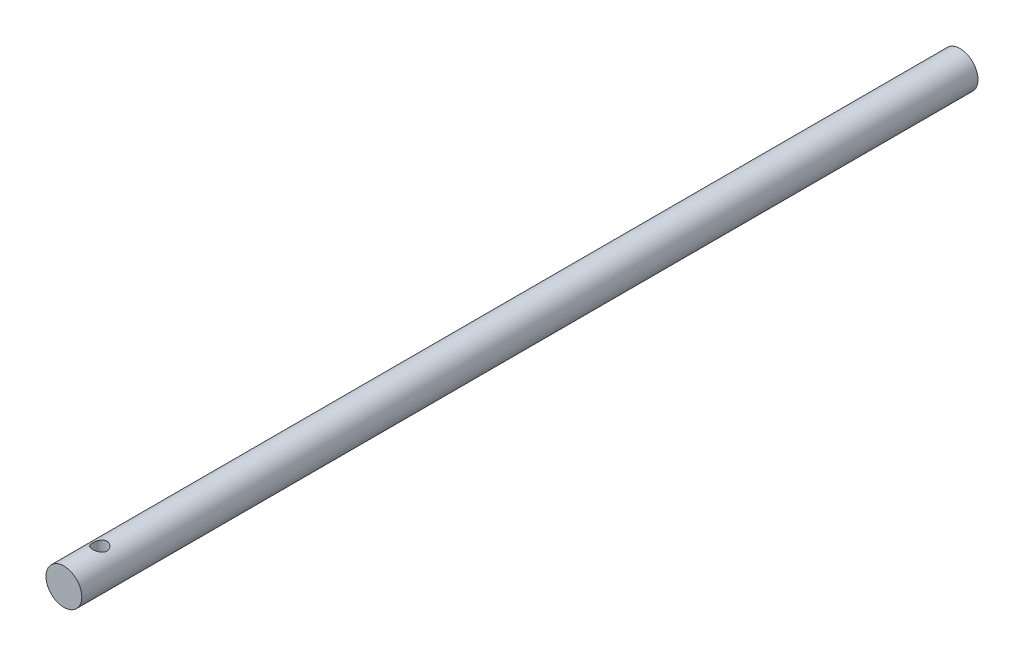
ISO-10303-21;
HEADER;
FILE_DESCRIPTION(('STEP AP214'),'2;1');
FILE_NAME('part.step','',(''),(''),'','','');
FILE_SCHEMA(('AUTOMOTIVE_DESIGN { 1 0 10303 214 1 1 1 1 }'));
ENDSEC;
DATA;
#1=APPLICATION_CONTEXT('core data for automotive mechanical design processes');
#2=APPLICATION_PROTOCOL_DEFINITION('international standard','automotive_design',2000,#1);
#3=PRODUCT_CONTEXT('',#1,'mechanical');
#4=PRODUCT('Part','Part','',(#3));
#5=PRODUCT_RELATED_PRODUCT_CATEGORY('part','',(#4));
#6=PRODUCT_DEFINITION_FORMATION('','',#4);
#7=PRODUCT_DEFINITION_CONTEXT('part definition',#1,'design');
#8=PRODUCT_DEFINITION('design','',#6,#7);
#9=PRODUCT_DEFINITION_SHAPE('','',#8);
#10=(LENGTH_UNIT() NAMED_UNIT(*) SI_UNIT(.MILLI.,.METRE.));
#11=(NAMED_UNIT(*) PLANE_ANGLE_UNIT() SI_UNIT($,.RADIAN.));
#12=(NAMED_UNIT(*) SI_UNIT($,.STERADIAN.) SOLID_ANGLE_UNIT());
#13=UNCERTAINTY_MEASURE_WITH_UNIT(LENGTH_MEASURE(1.E-05),#10,'distance_accuracy_value','');
#14=(GEOMETRIC_REPRESENTATION_CONTEXT(3) GLOBAL_UNCERTAINTY_ASSIGNED_CONTEXT((#13)) GLOBAL_UNIT_ASSIGNED_CONTEXT((#10,
#11,#12)) REPRESENTATION_CONTEXT('',''));
#15=CARTESIAN_POINT('',(0.,0.,0.));
#16=DIRECTION('',(0.,0.,1.));
#17=DIRECTION('',(1.,0.,0.));
#18=AXIS2_PLACEMENT_3D('',#15,#16,#17);
#19=CARTESIAN_POINT('',(0.,0.,25.));
#20=DIRECTION('',(0.,0.,-1.));
#21=DIRECTION('',(-1.,0.,0.));
#22=AXIS2_PLACEMENT_3D('',#19,#20,#21);
#23=CYLINDRICAL_SURFACE('',#22,0.5);
#24=CARTESIAN_POINT('',(0.,0.,0.));
#25=DIRECTION('',(0.,0.,1.));
#26=DIRECTION('',(1.,0.,0.));
#27=AXIS2_PLACEMENT_3D('',#24,#25,#26);
#28=CIRCLE('',#27,0.5);
#29=CARTESIAN_POINT('',(0.5,0.,0.));
#30=VERTEX_POINT('',#29);
#31=EDGE_CURVE('E42',#30,#30,#28,.T.);
#32=ORIENTED_EDGE('',*,*,#31,.T.);
#33=EDGE_LOOP('',(#32));
#34=FACE_BOUND('',#33,.T.);
#35=CARTESIAN_POINT('',(0.,0.,25.));
#36=DIRECTION('',(0.,0.,1.));
#37=DIRECTION('',(1.,0.,0.));
#38=AXIS2_PLACEMENT_3D('',#35,#36,#37);
#39=CIRCLE('',#38,0.5);
#40=CARTESIAN_POINT('',(0.5,0.,25.));
#41=VERTEX_POINT('',#40);
#42=EDGE_CURVE('E10',#41,#41,#39,.T.);
#43=ORIENTED_EDGE('',*,*,#42,.F.);
#44=EDGE_LOOP('',(#43));
#45=FACE_BOUND('',#44,.T.);
#46=CARTESIAN_POINT('',(0.,-0.5,1.2));
#47=CARTESIAN_POINT('',(0.0107493005442891,-0.499999271227087,1.19999901481763));
#48=CARTESIAN_POINT('',(0.0215172564090675,-0.49964929430695,1.19912822479116));
#49=CARTESIAN_POINT('',(0.0427496480417894,-0.498283453100624,1.19567522964788));
#50=CARTESIAN_POINT('',(0.0532131777561241,-0.497265778698808,1.19308837209139));
#51=CARTESIAN_POINT('',(0.0734953922727409,-0.494674209213187,1.18631239219411));
#52=CARTESIAN_POINT('',(0.0833160661616982,-0.493102136364329,1.18212851537831));
#53=CARTESIAN_POINT('',(0.102107197032834,-0.489556610795821,1.17229808266736));
#54=CARTESIAN_POINT('',(0.11107794767509,-0.487583297457099,1.16665203450816));
#55=CARTESIAN_POINT('',(0.128350100757049,-0.483330886171418,1.15377645014385));
#56=CARTESIAN_POINT('',(0.136606227255056,-0.481042296932994,1.14648933437576));
#57=CARTESIAN_POINT('',(0.151817500478437,-0.476460576902389,1.13065999965254));
#58=CARTESIAN_POINT('',(0.158772010713222,-0.474167444439568,1.12211717027963));
#59=CARTESIAN_POINT('',(0.171487456729425,-0.469722791811994,1.10355719297493));
#60=CARTESIAN_POINT('',(0.17718149812007,-0.467582116021552,1.09349135139447));
#61=CARTESIAN_POINT('',(0.186775471903192,-0.463833647130219,1.0724463601612));
#62=CARTESIAN_POINT('',(0.190676256426629,-0.462225601032779,1.06146764722715));
#63=CARTESIAN_POINT('',(0.19638988233933,-0.459826357863518,1.03942876663753));
#64=CARTESIAN_POINT('',(0.198289396584492,-0.459001421094231,1.02839487641736));
#65=CARTESIAN_POINT('',(0.200217296168208,-0.458164004781105,1.00613650013999));
#66=CARTESIAN_POINT('',(0.200246601631683,-0.458151125712644,0.994912110525707));
#67=CARTESIAN_POINT('',(0.198498936749452,-0.458910500103622,0.97342433285697));
#68=CARTESIAN_POINT('',(0.196847531430245,-0.459628174991155,0.963148428559841));
#69=CARTESIAN_POINT('',(0.191994688030051,-0.461676187655139,0.943034044398584));
#70=CARTESIAN_POINT('',(0.188792979480536,-0.463006632334469,0.933195641188768));
#71=CARTESIAN_POINT('',(0.180869473255033,-0.466159485075473,0.913998216380601));
#72=CARTESIAN_POINT('',(0.176117986231512,-0.46799137927728,0.904653076094586));
#73=CARTESIAN_POINT('',(0.165250646073241,-0.471938116393399,0.886858418363788));
#74=CARTESIAN_POINT('',(0.15913428051009,-0.474053065457821,0.878409239059704));
#75=CARTESIAN_POINT('',(0.145155059945437,-0.478526736741223,0.861959027119817));
#76=CARTESIAN_POINT('',(0.137193746297062,-0.480891664975871,0.854043127055403));
#77=CARTESIAN_POINT('',(0.120031442743021,-0.485459824958563,0.839631552199792));
#78=CARTESIAN_POINT('',(0.110830206533444,-0.4876630244454,0.83313616025897));
#79=CARTESIAN_POINT('',(0.0912077652605838,-0.491714681264471,0.821638255258418));
#80=CARTESIAN_POINT('',(0.0807660491346475,-0.493555270095395,0.816667771880295));
#81=CARTESIAN_POINT('',(0.0591023765482884,-0.496614828328779,0.808583213892194));
#82=CARTESIAN_POINT('',(0.0478808196849676,-0.497834113462385,0.805468196244259));
#83=CARTESIAN_POINT('',(0.0256895887607819,-0.499456139506908,0.80135517045803));
#84=CARTESIAN_POINT('',(0.014744329398553,-0.499902945833521,0.800242754574645));
#85=CARTESIAN_POINT('',(-0.00718453098078125,-0.500068478510624,0.799828689947138));
#86=CARTESIAN_POINT('',(-0.0181681213223906,-0.499787393582261,0.800526571845246));
#87=CARTESIAN_POINT('',(-0.0393432739122003,-0.498557567063783,0.803629175255202));
#88=CARTESIAN_POINT('',(-0.0495482491775534,-0.497639391345633,0.805955798035109));
#89=CARTESIAN_POINT('',(-0.0694135428060721,-0.495259441405391,0.81214357083097));
#90=CARTESIAN_POINT('',(-0.0790737910224623,-0.493797597356123,0.816004917966825));
#91=CARTESIAN_POINT('',(-0.097907878581693,-0.490416594771231,0.825278493968039));
#92=CARTESIAN_POINT('',(-0.107057802275627,-0.488484815981392,0.830734547204482));
#93=CARTESIAN_POINT('',(-0.124344359124569,-0.484373364743935,0.842994032390397));
#94=CARTESIAN_POINT('',(-0.13248058407579,-0.482193593104332,0.849798004291634));
#95=CARTESIAN_POINT('',(-0.148072304303225,-0.477645117644442,0.865087001295631));
#96=CARTESIAN_POINT('',(-0.155447393381928,-0.475273441449401,0.873653354153192));
#97=CARTESIAN_POINT('',(-0.16867511974005,-0.470741672892779,0.891944008298365));
#98=CARTESIAN_POINT('',(-0.174527506128809,-0.468581615435421,0.901668500024375));
#99=CARTESIAN_POINT('',(-0.184580750196974,-0.464714300000134,0.922146169466723));
#100=CARTESIAN_POINT('',(-0.188765059470202,-0.463011631230426,0.932908399952627));
#101=CARTESIAN_POINT('',(-0.195229621987339,-0.460323673746656,0.955073365204385));
#102=CARTESIAN_POINT('',(-0.197511280530937,-0.459337855635,0.966475620591511));
#103=CARTESIAN_POINT('',(-0.199971561723844,-0.458271759356656,0.988712790165407));
#104=CARTESIAN_POINT('',(-0.200289708230279,-0.458131421457964,0.999529483945808));
#105=CARTESIAN_POINT('',(-0.199180315929622,-0.458614836518446,1.02105448576408));
#106=CARTESIAN_POINT('',(-0.197752998791118,-0.459238492452737,1.03176280739076));
#107=CARTESIAN_POINT('',(-0.193307136614535,-0.461126648956595,1.05233321899002));
#108=CARTESIAN_POINT('',(-0.190353749356875,-0.46236483179458,1.06221202744451));
#109=CARTESIAN_POINT('',(-0.183000544849324,-0.465324001265575,1.08133786296014));
#110=CARTESIAN_POINT('',(-0.178600328139443,-0.467045121215045,1.09058471468965));
#111=CARTESIAN_POINT('',(-0.168187276275908,-0.470898609594936,1.10876096192743));
#112=CARTESIAN_POINT('',(-0.162096533515932,-0.473048882310676,1.11764186701314));
#113=CARTESIAN_POINT('',(-0.148589211927167,-0.477463804374804,1.13429933172028));
#114=CARTESIAN_POINT('',(-0.141172233481817,-0.479728488049114,1.14207555721281));
#115=CARTESIAN_POINT('',(-0.124650550627241,-0.48429356708664,1.15682028532639));
#116=CARTESIAN_POINT('',(-0.115467600114613,-0.486586757961983,1.16370373068981));
#117=CARTESIAN_POINT('',(-0.0959900320285794,-0.490800406713919,1.17583370426216));
#118=CARTESIAN_POINT('',(-0.0856949004547242,-0.49272069109296,1.18107947121525));
#119=CARTESIAN_POINT('',(-0.0644738062495201,-0.495939714815809,1.18966222151903));
#120=CARTESIAN_POINT('',(-0.0535631618219696,-0.497249363055014,1.19303293235603));
#121=CARTESIAN_POINT('',(-0.0312876546281223,-0.499144306209379,1.19786391209543));
#122=CARTESIAN_POINT('',(-0.0199243525858913,-0.49973189949564,1.19933024367439));
#123=CARTESIAN_POINT('',(-0.00569122978909299,-0.499975899504136,1.19993953809783));
#124=CARTESIAN_POINT('',(-0.00284626887407586,-0.500000192969175,1.20000026086292));
#125=CARTESIAN_POINT('',(0.,-0.5,1.2));
#126=B_SPLINE_CURVE_WITH_KNOTS('',3,(#46,#47,#48,#49,#50,#51,#52,#53,#54,#55,#56,#57,#58,#59,
#60,#61,#62,#63,#64,#65,#66,#67,#68,#69,#70,#71,#72,#73,#74,#75,#76,#77,#78,#79,#80,#81,#82,#83,
#84,#85,#86,#87,#88,#89,#90,#91,#92,#93,#94,#95,#96,#97,#98,#99,#100,#101,#102,#103,#104,#105,
#106,#107,#108,#109,#110,#111,#112,#113,#114,#115,#116,#117,#118,#119,#120,#121,#122,#123,#124,
#125),.UNSPECIFIED.,.T.,.F.,(4,2,2,2,2,2,2,2,2,2,2,2,2,2,2,2,2,2,2,2,2,2,2,2,2,2,2,2,2,2,2,2,2,
2,2,2,2,2,2,4),(0.,0.0322402987893071,0.0645683636007934,0.0967911457471581,0.129002753567984,
0.162597381700397,0.196208394934411,0.231315258819217,0.266405423118268,0.299904105283358,
0.333386306288518,0.364538328349403,0.395695787204078,0.427489126246847,0.459294421886214,
0.493558349134588,0.527829092787763,0.562776913110837,0.597706956061821,0.630569184476038,
0.663422893518113,0.694800455512396,0.726182048941827,0.758523513346293,0.790877959447,
0.825368474572444,0.859864668991778,0.894695045080729,0.929499672576373,0.961799673306808,
0.9940955724611,1.02511431844682,1.05614163570322,1.08894546795475,1.12175920124645,
1.15670042343189,1.19165786353859,1.22596430091137,1.2601612523024,1.26869804579485),.UNSPECIFIED.);
#127=CARTESIAN_POINT('',(0.,-0.5,1.2));
#128=VERTEX_POINT('',#127);
#129=EDGE_CURVE('E47',#128,#128,#126,.T.);
#130=ORIENTED_EDGE('',*,*,#129,.T.);
#131=EDGE_LOOP('',(#130));
#132=FACE_BOUND('',#131,.T.);
#133=CARTESIAN_POINT('',(0.,0.5,23.8));
#134=CARTESIAN_POINT('',(-0.0107493005442891,0.499999271227087,23.8000009851824));
#135=CARTESIAN_POINT('',(-0.0215172564090675,0.499649294306951,23.8008717752088));
#136=CARTESIAN_POINT('',(-0.0427496480417893,0.498283453100624,23.8043247703521));
#137=CARTESIAN_POINT('',(-0.053213177756124,0.497265778698808,23.8069116279086));
#138=CARTESIAN_POINT('',(-0.073495392272741,0.494674209213187,23.8136876078059));
#139=CARTESIAN_POINT('',(-0.0833160661616986,0.493102136364329,23.8178714846217));
#140=CARTESIAN_POINT('',(-0.102107197032834,0.489556610795821,23.8277019173326));
#141=CARTESIAN_POINT('',(-0.11107794767509,0.487583297457099,23.8333479654918));
#142=CARTESIAN_POINT('',(-0.128350100757049,0.483330886171418,23.8462235498562));
#143=CARTESIAN_POINT('',(-0.136606227255058,0.481042296932993,23.8535106656242));
#144=CARTESIAN_POINT('',(-0.151817500478439,0.476460576902389,23.8693400003475));
#145=CARTESIAN_POINT('',(-0.158772010713223,0.474167444439568,23.8778828297204));
#146=CARTESIAN_POINT('',(-0.171487456729425,0.469722791811994,23.8964428070251));
#147=CARTESIAN_POINT('',(-0.177181498120071,0.467582116021552,23.9065086486055));
#148=CARTESIAN_POINT('',(-0.186775471903192,0.463833647130219,23.9275536398388));
#149=CARTESIAN_POINT('',(-0.190676256426629,0.462225601032779,23.9385323527728));
#150=CARTESIAN_POINT('',(-0.19638988233933,0.459826357863518,23.9605712333625));
#151=CARTESIAN_POINT('',(-0.198289396584492,0.459001421094231,23.9716051235826));
#152=CARTESIAN_POINT('',(-0.200217296168207,0.458164004781105,23.99386349986));
#153=CARTESIAN_POINT('',(-0.200246601631682,0.458151125712644,24.0050878894743));
#154=CARTESIAN_POINT('',(-0.198498936749452,0.458910500103623,24.026575667143));
#155=CARTESIAN_POINT('',(-0.196847531430244,0.459628174991156,24.0368515714402));
#156=CARTESIAN_POINT('',(-0.19199468803005,0.46167618765514,24.0569659556014));
#157=CARTESIAN_POINT('',(-0.188792979480535,0.463006632334469,24.0668043588112));
#158=CARTESIAN_POINT('',(-0.180869473255032,0.466159485075473,24.0860017836194));
#159=CARTESIAN_POINT('',(-0.176117986231511,0.46799137927728,24.0953469239054));
#160=CARTESIAN_POINT('',(-0.165250646073242,0.471938116393399,24.1131415816362));
#161=CARTESIAN_POINT('',(-0.159134280510091,0.474053065457821,24.1215907609403));
#162=CARTESIAN_POINT('',(-0.145155059945437,0.478526736741223,24.1380409728802));
#163=CARTESIAN_POINT('',(-0.13719374629706,0.480891664975871,24.1459568729446));
#164=CARTESIAN_POINT('',(-0.120031442743019,0.485459824958564,24.1603684478002));
#165=CARTESIAN_POINT('',(-0.110830206533443,0.487663024445401,24.166863839741));
#166=CARTESIAN_POINT('',(-0.0912077652605826,0.491714681264471,24.1783617447416));
#167=CARTESIAN_POINT('',(-0.0807660491346455,0.493555270095395,24.1833322281197));
#168=CARTESIAN_POINT('',(-0.059102376548286,0.496614828328779,24.1914167861078));
#169=CARTESIAN_POINT('',(-0.0478808196849659,0.497834113462385,24.1945318037557));
#170=CARTESIAN_POINT('',(-0.025689588760781,0.499456139506908,24.198644829542));
#171=CARTESIAN_POINT('',(-0.0147443293985522,0.499902945833521,24.1997572454254));
#172=CARTESIAN_POINT('',(0.00718453098078151,0.500068478510624,24.2001713100529));
#173=CARTESIAN_POINT('',(0.0181681213223905,0.499787393582261,24.1994734281548));
#174=CARTESIAN_POINT('',(0.0393432739122,0.498557567063783,24.1963708247448));
#175=CARTESIAN_POINT('',(0.049548249177553,0.497639391345633,24.1940442019649));
#176=CARTESIAN_POINT('',(0.0694135428060718,0.495259441405391,24.187856429169));
#177=CARTESIAN_POINT('',(0.0790737910224621,0.493797597356123,24.1839950820332));
#178=CARTESIAN_POINT('',(0.0979078785816928,0.490416594771231,24.174721506032));
#179=CARTESIAN_POINT('',(0.107057802275627,0.488484815981392,24.1692654527955));
#180=CARTESIAN_POINT('',(0.124344359124569,0.484373364743936,24.1570059676096));
#181=CARTESIAN_POINT('',(0.132480584075789,0.482193593104333,24.1502019957084));
#182=CARTESIAN_POINT('',(0.148072304303224,0.477645117644442,24.1349129987044));
#183=CARTESIAN_POINT('',(0.155447393381927,0.475273441449401,24.1263466458468));
#184=CARTESIAN_POINT('',(0.168675119740049,0.470741672892779,24.1080559917016));
#185=CARTESIAN_POINT('',(0.174527506128808,0.468581615435421,24.0983314999756));
#186=CARTESIAN_POINT('',(0.184580750196973,0.464714300000135,24.0778538305333));
#187=CARTESIAN_POINT('',(0.188765059470202,0.463011631230426,24.0670916000474));
#188=CARTESIAN_POINT('',(0.195229621987338,0.460323673746656,24.0449266347956));
#189=CARTESIAN_POINT('',(0.197511280530937,0.459337855635,24.0335243794085));
#190=CARTESIAN_POINT('',(0.199971561723844,0.458271759356656,24.0112872098346));
#191=CARTESIAN_POINT('',(0.200289708230278,0.458131421457965,24.0004705160542));
#192=CARTESIAN_POINT('',(0.199180315929621,0.458614836518446,23.9789455142359));
#193=CARTESIAN_POINT('',(0.197752998791117,0.459238492452737,23.9682371926092));
#194=CARTESIAN_POINT('',(0.193307136614535,0.461126648956595,23.94766678101));
#195=CARTESIAN_POINT('',(0.190353749356875,0.46236483179458,23.9377879725555));
#196=CARTESIAN_POINT('',(0.183000544849324,0.465324001265575,23.9186621370399));
#197=CARTESIAN_POINT('',(0.178600328139442,0.467045121215045,23.9094152853104));
#198=CARTESIAN_POINT('',(0.168187276275907,0.470898609594936,23.8912390380726));
#199=CARTESIAN_POINT('',(0.162096533515929,0.473048882310677,23.8823581329869));
#200=CARTESIAN_POINT('',(0.148589211927165,0.477463804374805,23.8657006682797));
#201=CARTESIAN_POINT('',(0.141172233481816,0.479728488049115,23.8579244427872));
#202=CARTESIAN_POINT('',(0.124650550627241,0.484293567086641,23.8431797146736));
#203=CARTESIAN_POINT('',(0.115467600114612,0.486586757961984,23.8362962693102));
#204=CARTESIAN_POINT('',(0.0959900320285785,0.490800406713919,23.8241662957378));
#205=CARTESIAN_POINT('',(0.0856949004547236,0.49272069109296,23.8189205287848));
#206=CARTESIAN_POINT('',(0.0644738062495198,0.495939714815809,23.810337778481));
#207=CARTESIAN_POINT('',(0.0535631618219694,0.497249363055014,23.806967067644));
#208=CARTESIAN_POINT('',(0.031287654628122,0.49914430620938,23.8021360879046));
#209=CARTESIAN_POINT('',(0.019924352585891,0.49973189949564,23.8006697563256));
#210=CARTESIAN_POINT('',(0.00569122978909294,0.499975899504136,23.8000604619022));
#211=CARTESIAN_POINT('',(0.00284626887407584,0.500000192969175,23.7999997391371));
#212=CARTESIAN_POINT('',(0.,0.5,23.8));
#213=B_SPLINE_CURVE_WITH_KNOTS('',3,(#133,#134,#135,#136,#137,#138,#139,#140,#141,#142,#143,
#144,#145,#146,#147,#148,#149,#150,#151,#152,#153,#154,#155,#156,#157,#158,#159,#160,#161,#162,
#163,#164,#165,#166,#167,#168,#169,#170,#171,#172,#173,#174,#175,#176,#177,#178,#179,#180,#181,
#182,#183,#184,#185,#186,#187,#188,#189,#190,#191,#192,#193,#194,#195,#196,#197,#198,#199,#200,
#201,#202,#203,#204,#205,#206,#207,#208,#209,#210,#211,#212),.UNSPECIFIED.,.T.,.F.,(4,2,2,2,2,2,
2,2,2,2,2,2,2,2,2,2,2,2,2,2,2,2,2,2,2,2,2,2,2,2,2,2,2,2,2,2,2,2,2,4),(0.,0.032240298789307,
0.0645683636007931,0.0967911457471585,0.129002753567985,0.162597381700399,0.196208394934414,
0.231315258819217,0.266405423118266,0.299904105283362,0.33338630628852,0.364538328349402,
0.395695787204079,0.427489126246844,0.459294421886211,0.493558349134587,0.527829092787763,
0.562776913110837,0.59770695606182,0.630569184476036,0.66342289351811,0.694800455512394,
0.726182048941825,0.75852351334629,0.790877959446996,0.825368474572441,0.859864668991775,
0.894695045080729,0.929499672576368,0.961799673306801,0.994095572461095,1.02511431844681,
1.05614163570321,1.08894546795475,1.12175920124644,1.15670042343188,1.19165786353858,
1.22596430091137,1.26016125230239,1.26869804579484),.UNSPECIFIED.);
#214=CARTESIAN_POINT('',(0.,0.5,23.8));
#215=VERTEX_POINT('',#214);
#216=EDGE_CURVE('E35',#215,#215,#213,.T.);
#217=ORIENTED_EDGE('',*,*,#216,.F.);
#218=EDGE_LOOP('',(#217));
#219=FACE_BOUND('',#218,.T.);
#220=ADVANCED_FACE('F31',(#34,#45,#132,#219),#23,.T.);
#221=CARTESIAN_POINT('',(0.,0.,25.));
#222=DIRECTION('',(0.,0.,1.));
#223=DIRECTION('',(1.,0.,0.));
#224=AXIS2_PLACEMENT_3D('',#221,#222,#223);
#225=PLANE('',#224);
#226=ORIENTED_EDGE('',*,*,#42,.T.);
#227=EDGE_LOOP('',(#226));
#228=FACE_BOUND('',#227,.T.);
#229=ADVANCED_FACE('F64',(#228),#225,.T.);
#230=CARTESIAN_POINT('',(0.,0.,0.));
#231=DIRECTION('',(0.,0.,1.));
#232=DIRECTION('',(1.,0.,0.));
#233=AXIS2_PLACEMENT_3D('',#230,#231,#232);
#234=PLANE('',#233);
#235=ORIENTED_EDGE('',*,*,#31,.F.);
#236=EDGE_LOOP('',(#235));
#237=FACE_BOUND('',#236,.T.);
#238=ADVANCED_FACE('F62',(#237),#234,.F.);
#239=CARTESIAN_POINT('',(0.,-1.,1.));
#240=DIRECTION('',(0.,1.,0.));
#241=DIRECTION('',(0.,0.,1.));
#242=AXIS2_PLACEMENT_3D('',#239,#240,#241);
#243=CYLINDRICAL_SURFACE('',#242,0.2);
#244=CARTESIAN_POINT('',(0.,0.,1.));
#245=DIRECTION('',(0.,1.,0.));
#246=DIRECTION('',(0.,0.,1.));
#247=AXIS2_PLACEMENT_3D('',#244,#245,#246);
#248=CIRCLE('',#247,0.2);
#249=CARTESIAN_POINT('',(0.,0.,1.2));
#250=VERTEX_POINT('',#249);
#251=EDGE_CURVE('E50',#250,#250,#248,.T.);
#252=ORIENTED_EDGE('',*,*,#251,.T.);
#253=EDGE_LOOP('',(#252));
#254=FACE_BOUND('',#253,.T.);
#255=ORIENTED_EDGE('',*,*,#129,.F.);
#256=EDGE_LOOP('',(#255));
#257=FACE_BOUND('',#256,.T.);
#258=ADVANCED_FACE('F56',(#254,#257),#243,.F.);
#259=CARTESIAN_POINT('',(0.,0.,1.));
#260=DIRECTION('',(0.,1.,0.));
#261=DIRECTION('',(0.,0.,1.));
#262=AXIS2_PLACEMENT_3D('',#259,#260,#261);
#263=PLANE('',#262);
#264=ORIENTED_EDGE('',*,*,#251,.F.);
#265=EDGE_LOOP('',(#264));
#266=FACE_BOUND('',#265,.T.);
#267=ADVANCED_FACE('F61',(#266),#263,.F.);
#268=CARTESIAN_POINT('',(0.,1.,24.));
#269=DIRECTION('',(0.,-1.,0.));
#270=DIRECTION('',(0.,0.,-1.));
#271=AXIS2_PLACEMENT_3D('',#268,#269,#270);
#272=CYLINDRICAL_SURFACE('',#271,0.199999999999999);
#273=CARTESIAN_POINT('',(0.,0.,24.));
#274=DIRECTION('',(0.,1.,0.));
#275=DIRECTION('',(0.,0.,1.));
#276=AXIS2_PLACEMENT_3D('',#273,#274,#275);
#277=CIRCLE('',#276,0.199999999999999);
#278=CARTESIAN_POINT('',(0.,0.,24.2));
#279=VERTEX_POINT('',#278);
#280=EDGE_CURVE('E82',#279,#279,#277,.T.);
#281=ORIENTED_EDGE('',*,*,#280,.F.);
#282=EDGE_LOOP('',(#281));
#283=FACE_BOUND('',#282,.T.);
#284=ORIENTED_EDGE('',*,*,#216,.T.);
#285=EDGE_LOOP('',(#284));
#286=FACE_BOUND('',#285,.T.);
#287=ADVANCED_FACE('F89',(#283,#286),#272,.F.);
#288=CARTESIAN_POINT('',(0.,0.,24.));
#289=DIRECTION('',(0.,1.,0.));
#290=DIRECTION('',(0.,0.,1.));
#291=AXIS2_PLACEMENT_3D('',#288,#289,#290);
#292=PLANE('',#291);
#293=ORIENTED_EDGE('',*,*,#280,.T.);
#294=EDGE_LOOP('',(#293));
#295=FACE_BOUND('',#294,.T.);
#296=ADVANCED_FACE('F87',(#295),#292,.T.);
#297=CLOSED_SHELL('',(#220,#229,#238,#258,#267,#287,#296));
#298=MANIFOLD_SOLID_BREP('B2',#297);
#299=ADVANCED_BREP_SHAPE_REPRESENTATION('',(#18,#298),#14);
#300=SHAPE_DEFINITION_REPRESENTATION(#9,#299);
ENDSEC;
END-ISO-10303-21;
